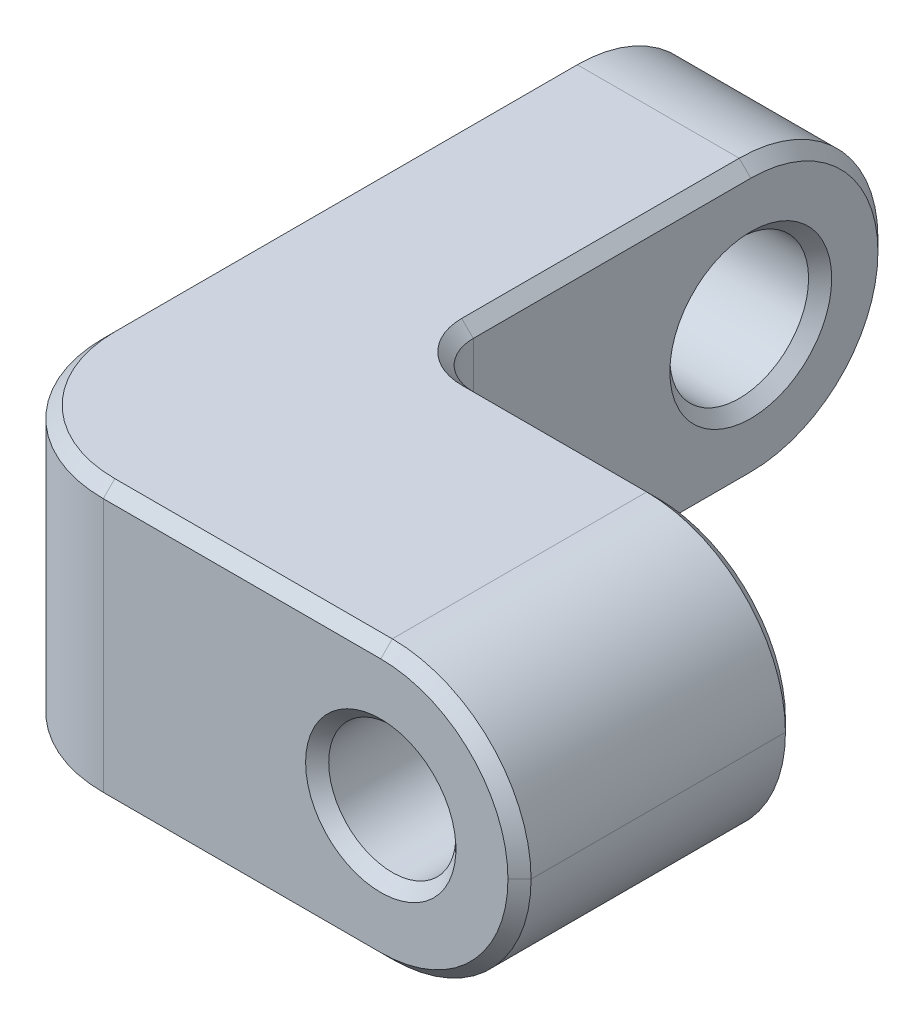
ISO-10303-21;
HEADER;
FILE_DESCRIPTION(('STEP AP214'),'2;1');
FILE_NAME('part.step','',(''),(''),'','','');
FILE_SCHEMA(('AUTOMOTIVE_DESIGN { 1 0 10303 214 1 1 1 1 }'));
ENDSEC;
DATA;
#1=APPLICATION_CONTEXT('core data for automotive mechanical design processes');
#2=APPLICATION_PROTOCOL_DEFINITION('international standard','automotive_design',2000,#1);
#3=PRODUCT_CONTEXT('',#1,'mechanical');
#4=PRODUCT('Part','Part','',(#3));
#5=PRODUCT_RELATED_PRODUCT_CATEGORY('part','',(#4));
#6=PRODUCT_DEFINITION_FORMATION('','',#4);
#7=PRODUCT_DEFINITION_CONTEXT('part definition',#1,'design');
#8=PRODUCT_DEFINITION('design','',#6,#7);
#9=PRODUCT_DEFINITION_SHAPE('','',#8);
#10=(LENGTH_UNIT() NAMED_UNIT(*) SI_UNIT(.MILLI.,.METRE.));
#11=(NAMED_UNIT(*) PLANE_ANGLE_UNIT() SI_UNIT($,.RADIAN.));
#12=(NAMED_UNIT(*) SI_UNIT($,.STERADIAN.) SOLID_ANGLE_UNIT());
#13=UNCERTAINTY_MEASURE_WITH_UNIT(LENGTH_MEASURE(1.E-05),#10,'distance_accuracy_value','');
#14=(GEOMETRIC_REPRESENTATION_CONTEXT(3) GLOBAL_UNCERTAINTY_ASSIGNED_CONTEXT((#13)) GLOBAL_UNIT_ASSIGNED_CONTEXT((#10,
#11,#12)) REPRESENTATION_CONTEXT('',''));
#15=CARTESIAN_POINT('',(0.,0.,0.));
#16=DIRECTION('',(0.,0.,1.));
#17=DIRECTION('',(1.,0.,0.));
#18=AXIS2_PLACEMENT_3D('',#15,#16,#17);
#19=CARTESIAN_POINT('',(0.,4.7625,-25.4));
#20=DIRECTION('',(1.,0.,0.));
#21=DIRECTION('',(0.,0.,-1.));
#22=AXIS2_PLACEMENT_3D('',#19,#20,#21);
#23=PLANE('',#22);
#24=CARTESIAN_POINT('',(0.,0.,-20.6375));
#25=DIRECTION('',(1.,0.,0.));
#26=DIRECTION('',(0.,0.,-1.));
#27=AXIS2_PLACEMENT_3D('',#24,#25,#26);
#28=CIRCLE('',#27,2.77812499999995);
#29=CARTESIAN_POINT('',(0.,0.,-23.4156249999999));
#30=VERTEX_POINT('',#29);
#31=EDGE_CURVE('E461',#30,#30,#28,.T.);
#32=ORIENTED_EDGE('',*,*,#31,.T.);
#33=EDGE_LOOP('',(#32));
#34=FACE_BOUND('',#33,.T.);
#35=CARTESIAN_POINT('',(0.,0.,-20.6375));
#36=DIRECTION('',(1.,0.,0.));
#37=DIRECTION('',(0.,0.,-1.));
#38=AXIS2_PLACEMENT_3D('',#35,#36,#37);
#39=CIRCLE('',#38,4.365625);
#40=CARTESIAN_POINT('',(0.,0.,-25.003125));
#41=VERTEX_POINT('',#40);
#42=CARTESIAN_POINT('',(0.,-4.365625,-20.6375));
#43=VERTEX_POINT('',#42);
#44=EDGE_CURVE('E454',#41,#43,#39,.F.);
#45=ORIENTED_EDGE('',*,*,#44,.T.);
#46=DIRECTION('',(0.,0.,1.));
#47=VECTOR('',#46,1.);
#48=CARTESIAN_POINT('',(0.,-4.365625,-25.4));
#49=LINE('',#48,#47);
#50=CARTESIAN_POINT('',(0.,-4.365625,-4.7625));
#51=VERTEX_POINT('',#50);
#52=EDGE_CURVE('E458',#43,#51,#49,.T.);
#53=ORIENTED_EDGE('',*,*,#52,.T.);
#54=DIRECTION('',(0.,-1.,0.));
#55=VECTOR('',#54,1.);
#56=CARTESIAN_POINT('',(0.,4.7625,-4.7625));
#57=LINE('',#56,#55);
#58=CARTESIAN_POINT('',(0.,4.365625,-4.7625));
#59=VERTEX_POINT('',#58);
#60=EDGE_CURVE('E476',#51,#59,#57,.F.);
#61=ORIENTED_EDGE('',*,*,#60,.T.);
#62=DIRECTION('',(0.,0.,-1.));
#63=VECTOR('',#62,1.);
#64=CARTESIAN_POINT('',(0.,4.365625,-20.6375));
#65=LINE('',#64,#63);
#66=CARTESIAN_POINT('',(0.,4.365625,-20.6375));
#67=VERTEX_POINT('',#66);
#68=EDGE_CURVE('E448',#59,#67,#65,.T.);
#69=ORIENTED_EDGE('',*,*,#68,.T.);
#70=CARTESIAN_POINT('',(0.,0.,-20.6375));
#71=DIRECTION('',(1.,0.,0.));
#72=DIRECTION('',(0.,0.,-1.));
#73=AXIS2_PLACEMENT_3D('',#70,#71,#72);
#74=CIRCLE('',#73,4.365625);
#75=EDGE_CURVE('E451',#67,#41,#74,.F.);
#76=ORIENTED_EDGE('',*,*,#75,.T.);
#77=EDGE_LOOP('',(#45,#53,#61,#69,#76));
#78=FACE_BOUND('',#77,.T.);
#79=ADVANCED_FACE('F41',(#34,#78),#23,.F.);
#80=CARTESIAN_POINT('',(0.,4.7625,0.));
#81=DIRECTION('',(0.,0.,-1.));
#82=DIRECTION('',(-1.,0.,0.));
#83=AXIS2_PLACEMENT_3D('',#80,#81,#82);
#84=PLANE('',#83);
#85=CARTESIAN_POINT('',(14.2875,0.,0.));
#86=DIRECTION('',(0.,0.,-1.));
#87=DIRECTION('',(-1.,0.,0.));
#88=AXIS2_PLACEMENT_3D('',#85,#86,#87);
#89=CIRCLE('',#88,2.57968750000001);
#90=CARTESIAN_POINT('',(11.7078125,0.,0.));
#91=VERTEX_POINT('',#90);
#92=EDGE_CURVE('E364',#91,#91,#89,.T.);
#93=ORIENTED_EDGE('',*,*,#92,.T.);
#94=EDGE_LOOP('',(#93));
#95=FACE_BOUND('',#94,.T.);
#96=DIRECTION('',(0.,-1.,0.));
#97=VECTOR('',#96,1.);
#98=CARTESIAN_POINT('',(4.7625,4.7625,0.));
#99=LINE('',#98,#97);
#100=CARTESIAN_POINT('',(4.7625,4.365625,0.));
#101=VERTEX_POINT('',#100);
#102=CARTESIAN_POINT('',(4.7625,-4.365625,0.));
#103=VERTEX_POINT('',#102);
#104=EDGE_CURVE('E687',#101,#103,#99,.T.);
#105=ORIENTED_EDGE('',*,*,#104,.T.);
#106=DIRECTION('',(1.,0.,0.));
#107=VECTOR('',#106,1.);
#108=CARTESIAN_POINT('',(0.,-4.365625,0.));
#109=LINE('',#108,#107);
#110=CARTESIAN_POINT('',(14.2875,-4.365625,0.));
#111=VERTEX_POINT('',#110);
#112=EDGE_CURVE('E377',#103,#111,#109,.T.);
#113=ORIENTED_EDGE('',*,*,#112,.T.);
#114=CARTESIAN_POINT('',(14.2875,0.,0.));
#115=DIRECTION('',(0.,0.,-1.));
#116=DIRECTION('',(-1.,0.,0.));
#117=AXIS2_PLACEMENT_3D('',#114,#115,#116);
#118=CIRCLE('',#117,4.365625);
#119=CARTESIAN_POINT('',(18.653125,0.,0.));
#120=VERTEX_POINT('',#119);
#121=EDGE_CURVE('E374',#111,#120,#118,.F.);
#122=ORIENTED_EDGE('',*,*,#121,.T.);
#123=CARTESIAN_POINT('',(14.2875,0.,0.));
#124=DIRECTION('',(0.,0.,-1.));
#125=DIRECTION('',(-1.,0.,0.));
#126=AXIS2_PLACEMENT_3D('',#123,#124,#125);
#127=CIRCLE('',#126,4.365625);
#128=CARTESIAN_POINT('',(14.2875,4.365625,0.));
#129=VERTEX_POINT('',#128);
#130=EDGE_CURVE('E371',#120,#129,#127,.F.);
#131=ORIENTED_EDGE('',*,*,#130,.T.);
#132=DIRECTION('',(-1.,0.,0.));
#133=VECTOR('',#132,1.);
#134=CARTESIAN_POINT('',(4.7625,4.365625,0.));
#135=LINE('',#134,#133);
#136=EDGE_CURVE('E368',#129,#101,#135,.T.);
#137=ORIENTED_EDGE('',*,*,#136,.T.);
#138=EDGE_LOOP('',(#105,#113,#122,#131,#137));
#139=FACE_BOUND('',#138,.T.);
#140=ADVANCED_FACE('F490',(#95,#139),#84,.F.);
#141=CARTESIAN_POINT('',(19.05,4.7625,-9.525));
#142=DIRECTION('',(0.,0.,1.));
#143=DIRECTION('',(1.,0.,0.));
#144=AXIS2_PLACEMENT_3D('',#141,#142,#143);
#145=PLANE('',#144);
#146=CARTESIAN_POINT('',(14.2875,0.,-9.525));
#147=DIRECTION('',(0.,0.,1.));
#148=DIRECTION('',(1.,0.,0.));
#149=AXIS2_PLACEMENT_3D('',#146,#147,#148);
#150=CIRCLE('',#149,2.5796875);
#151=CARTESIAN_POINT('',(16.8671875,0.,-9.525));
#152=VERTEX_POINT('',#151);
#153=EDGE_CURVE('E213',#152,#152,#150,.T.);
#154=ORIENTED_EDGE('',*,*,#153,.T.);
#155=EDGE_LOOP('',(#154));
#156=FACE_BOUND('',#155,.T.);
#157=DIRECTION('',(0.,-1.,0.));
#158=VECTOR('',#157,1.);
#159=CARTESIAN_POINT('',(7.93749999999999,4.7625,-9.525));
#160=LINE('',#159,#158);
#161=CARTESIAN_POINT('',(7.93749999999999,-4.365625,-9.525));
#162=VERTEX_POINT('',#161);
#163=CARTESIAN_POINT('',(7.93749999999999,4.365625,-9.525));
#164=VERTEX_POINT('',#163);
#165=EDGE_CURVE('E200',#162,#164,#160,.F.);
#166=ORIENTED_EDGE('',*,*,#165,.T.);
#167=DIRECTION('',(1.,0.,0.));
#168=VECTOR('',#167,1.);
#169=CARTESIAN_POINT('',(14.2875,4.365625,-9.525));
#170=LINE('',#169,#168);
#171=CARTESIAN_POINT('',(14.2875,4.365625,-9.525));
#172=VERTEX_POINT('',#171);
#173=EDGE_CURVE('E11',#164,#172,#170,.T.);
#174=ORIENTED_EDGE('',*,*,#173,.T.);
#175=CARTESIAN_POINT('',(14.2875,0.,-9.525));
#176=DIRECTION('',(0.,0.,1.));
#177=DIRECTION('',(1.,0.,0.));
#178=AXIS2_PLACEMENT_3D('',#175,#176,#177);
#179=CIRCLE('',#178,4.365625);
#180=CARTESIAN_POINT('',(18.653125,0.,-9.525));
#181=VERTEX_POINT('',#180);
#182=EDGE_CURVE('E52',#172,#181,#179,.F.);
#183=ORIENTED_EDGE('',*,*,#182,.T.);
#184=CARTESIAN_POINT('',(14.2875,0.,-9.525));
#185=DIRECTION('',(0.,0.,1.));
#186=DIRECTION('',(1.,0.,0.));
#187=AXIS2_PLACEMENT_3D('',#184,#185,#186);
#188=CIRCLE('',#187,4.365625);
#189=CARTESIAN_POINT('',(14.2875,-4.365625,-9.525));
#190=VERTEX_POINT('',#189);
#191=EDGE_CURVE('E408',#181,#190,#188,.F.);
#192=ORIENTED_EDGE('',*,*,#191,.T.);
#193=DIRECTION('',(-1.,0.,0.));
#194=VECTOR('',#193,1.);
#195=CARTESIAN_POINT('',(19.05,-4.365625,-9.525));
#196=LINE('',#195,#194);
#197=EDGE_CURVE('E405',#190,#162,#196,.T.);
#198=ORIENTED_EDGE('',*,*,#197,.T.);
#199=EDGE_LOOP('',(#166,#174,#183,#192,#198));
#200=FACE_BOUND('',#199,.T.);
#201=ADVANCED_FACE('F411',(#156,#200),#145,.F.);
#202=CARTESIAN_POINT('',(6.35,4.7625,-9.525));
#203=DIRECTION('',(-1.,0.,0.));
#204=DIRECTION('',(0.,0.,1.));
#205=AXIS2_PLACEMENT_3D('',#202,#203,#204);
#206=PLANE('',#205);
#207=CARTESIAN_POINT('',(6.34999999999998,0.,-20.6375));
#208=DIRECTION('',(-1.,0.,0.));
#209=DIRECTION('',(0.,0.,1.));
#210=AXIS2_PLACEMENT_3D('',#207,#208,#209);
#211=CIRCLE('',#210,2.77812499999999);
#212=CARTESIAN_POINT('',(6.34999999999999,0.,-17.859375));
#213=VERTEX_POINT('',#212);
#214=EDGE_CURVE('E190',#213,#213,#211,.T.);
#215=ORIENTED_EDGE('',*,*,#214,.T.);
#216=EDGE_LOOP('',(#215));
#217=FACE_BOUND('',#216,.T.);
#218=CARTESIAN_POINT('',(6.34999999999998,0.,-20.6375));
#219=DIRECTION('',(-1.,0.,0.));
#220=DIRECTION('',(0.,0.,1.));
#221=AXIS2_PLACEMENT_3D('',#218,#219,#220);
#222=CIRCLE('',#221,4.365625);
#223=CARTESIAN_POINT('',(6.34999999999998,0.,-25.003125));
#224=VERTEX_POINT('',#223);
#225=CARTESIAN_POINT('',(6.34999999999998,4.365625,-20.6375));
#226=VERTEX_POINT('',#225);
#227=EDGE_CURVE('E185',#224,#226,#222,.F.);
#228=ORIENTED_EDGE('',*,*,#227,.T.);
#229=DIRECTION('',(0.,0.,1.));
#230=VECTOR('',#229,1.);
#231=CARTESIAN_POINT('',(6.34999999999999,4.365625,-11.1125));
#232=LINE('',#231,#230);
#233=CARTESIAN_POINT('',(6.34999999999999,4.365625,-11.1125));
#234=VERTEX_POINT('',#233);
#235=EDGE_CURVE('E179',#226,#234,#232,.T.);
#236=ORIENTED_EDGE('',*,*,#235,.T.);
#237=DIRECTION('',(0.,-1.,0.));
#238=VECTOR('',#237,1.);
#239=CARTESIAN_POINT('',(6.34999999999999,-4.7625,-11.1125));
#240=LINE('',#239,#238);
#241=CARTESIAN_POINT('',(6.34999999999999,-4.365625,-11.1125));
#242=VERTEX_POINT('',#241);
#243=EDGE_CURVE('E182',#234,#242,#240,.T.);
#244=ORIENTED_EDGE('',*,*,#243,.T.);
#245=DIRECTION('',(0.,0.,-1.));
#246=VECTOR('',#245,1.);
#247=CARTESIAN_POINT('',(6.35,-4.365625,-9.525));
#248=LINE('',#247,#246);
#249=CARTESIAN_POINT('',(6.34999999999998,-4.365625,-20.6375));
#250=VERTEX_POINT('',#249);
#251=EDGE_CURVE('E424',#242,#250,#248,.T.);
#252=ORIENTED_EDGE('',*,*,#251,.T.);
#253=CARTESIAN_POINT('',(6.34999999999998,0.,-20.6375));
#254=DIRECTION('',(-1.,0.,0.));
#255=DIRECTION('',(0.,0.,1.));
#256=AXIS2_PLACEMENT_3D('',#253,#254,#255);
#257=CIRCLE('',#256,4.365625);
#258=EDGE_CURVE('E428',#250,#224,#257,.F.);
#259=ORIENTED_EDGE('',*,*,#258,.T.);
#260=EDGE_LOOP('',(#228,#236,#244,#252,#259));
#261=FACE_BOUND('',#260,.T.);
#262=ADVANCED_FACE('F181',(#217,#261),#206,.F.);
#263=CARTESIAN_POINT('',(0.,4.7625,0.));
#264=DIRECTION('',(0.,1.,0.));
#265=DIRECTION('',(0.,0.,1.));
#266=AXIS2_PLACEMENT_3D('',#263,#264,#265);
#267=PLANE('',#266);
#268=DIRECTION('',(-1.,0.,0.));
#269=VECTOR('',#268,1.);
#270=CARTESIAN_POINT('',(0.,4.7625,-20.6375));
#271=LINE('',#270,#269);
#272=CARTESIAN_POINT('',(5.95312499999998,4.7625,-20.6375));
#273=VERTEX_POINT('',#272);
#274=CARTESIAN_POINT('',(0.396874999999981,4.7625,-20.6375));
#275=VERTEX_POINT('',#274);
#276=EDGE_CURVE('E201',#273,#275,#271,.T.);
#277=ORIENTED_EDGE('',*,*,#276,.T.);
#278=DIRECTION('',(0.,0.,1.));
#279=VECTOR('',#278,1.);
#280=CARTESIAN_POINT('',(0.396874999999994,4.7625,-4.7625));
#281=LINE('',#280,#279);
#282=CARTESIAN_POINT('',(0.396874999999994,4.7625,-4.7625));
#283=VERTEX_POINT('',#282);
#284=EDGE_CURVE('E355',#275,#283,#281,.T.);
#285=ORIENTED_EDGE('',*,*,#284,.T.);
#286=CARTESIAN_POINT('',(4.7625,4.7625,-4.7625));
#287=DIRECTION('',(0.,1.,0.));
#288=DIRECTION('',(0.,0.,1.));
#289=AXIS2_PLACEMENT_3D('',#286,#287,#288);
#290=CIRCLE('',#289,4.365625);
#291=CARTESIAN_POINT('',(4.7625,4.7625,-0.396874999999998));
#292=VERTEX_POINT('',#291);
#293=EDGE_CURVE('E352',#283,#292,#290,.T.);
#294=ORIENTED_EDGE('',*,*,#293,.T.);
#295=DIRECTION('',(1.,0.,0.));
#296=VECTOR('',#295,1.);
#297=CARTESIAN_POINT('',(14.2875,4.7625,-0.396874999999998));
#298=LINE('',#297,#296);
#299=CARTESIAN_POINT('',(14.2875,4.7625,-0.396874999999998));
#300=VERTEX_POINT('',#299);
#301=EDGE_CURVE('E349',#292,#300,#298,.T.);
#302=ORIENTED_EDGE('',*,*,#301,.T.);
#303=DIRECTION('',(0.,0.,-1.));
#304=VECTOR('',#303,1.);
#305=CARTESIAN_POINT('',(14.2875,4.7625,-9.525));
#306=LINE('',#305,#304);
#307=CARTESIAN_POINT('',(14.2875,4.7625,-9.12812499999999));
#308=VERTEX_POINT('',#307);
#309=EDGE_CURVE('E670',#300,#308,#306,.T.);
#310=ORIENTED_EDGE('',*,*,#309,.T.);
#311=DIRECTION('',(-1.,0.,0.));
#312=VECTOR('',#311,1.);
#313=CARTESIAN_POINT('',(7.93749999999999,4.7625,-9.12812499999999));
#314=LINE('',#313,#312);
#315=CARTESIAN_POINT('',(7.93749999999999,4.7625,-9.12812499999999));
#316=VERTEX_POINT('',#315);
#317=EDGE_CURVE('E341',#308,#316,#314,.T.);
#318=ORIENTED_EDGE('',*,*,#317,.T.);
#319=CARTESIAN_POINT('',(7.93749999999999,4.7625,-11.1125));
#320=DIRECTION('',(0.,1.,0.));
#321=DIRECTION('',(0.,0.,1.));
#322=AXIS2_PLACEMENT_3D('',#319,#320,#321);
#323=CIRCLE('',#322,1.98437500000001);
#324=CARTESIAN_POINT('',(5.95312499999999,4.7625,-11.1125));
#325=VERTEX_POINT('',#324);
#326=EDGE_CURVE('E344',#316,#325,#323,.F.);
#327=ORIENTED_EDGE('',*,*,#326,.T.);
#328=DIRECTION('',(0.,0.,-1.));
#329=VECTOR('',#328,1.);
#330=CARTESIAN_POINT('',(5.95312499999998,4.7625,-20.6375));
#331=LINE('',#330,#329);
#332=EDGE_CURVE('E216',#325,#273,#331,.T.);
#333=ORIENTED_EDGE('',*,*,#332,.T.);
#334=EDGE_LOOP('',(#277,#285,#294,#302,#310,#318,#327,#333));
#335=FACE_BOUND('',#334,.T.);
#336=ADVANCED_FACE('F675',(#335),#267,.T.);
#337=CARTESIAN_POINT('',(0.,-4.7625,0.));
#338=DIRECTION('',(0.,1.,0.));
#339=DIRECTION('',(0.,0.,1.));
#340=AXIS2_PLACEMENT_3D('',#337,#338,#339);
#341=PLANE('',#340);
#342=CARTESIAN_POINT('',(4.7625,-4.7625,-4.7625));
#343=DIRECTION('',(0.,1.,0.));
#344=DIRECTION('',(0.,0.,1.));
#345=AXIS2_PLACEMENT_3D('',#342,#343,#344);
#346=CIRCLE('',#345,4.365625);
#347=CARTESIAN_POINT('',(4.7625,-4.7625,-0.396874999999998));
#348=VERTEX_POINT('',#347);
#349=CARTESIAN_POINT('',(0.396874999999995,-4.7625,-4.7625));
#350=VERTEX_POINT('',#349);
#351=EDGE_CURVE('E335',#348,#350,#346,.F.);
#352=ORIENTED_EDGE('',*,*,#351,.T.);
#353=DIRECTION('',(0.,0.,-1.));
#354=VECTOR('',#353,1.);
#355=CARTESIAN_POINT('',(0.396874999999998,-4.7625,0.));
#356=LINE('',#355,#354);
#357=CARTESIAN_POINT('',(0.396874999999981,-4.7625,-20.6375));
#358=VERTEX_POINT('',#357);
#359=EDGE_CURVE('E338',#350,#358,#356,.T.);
#360=ORIENTED_EDGE('',*,*,#359,.T.);
#361=DIRECTION('',(-1.,0.,0.));
#362=VECTOR('',#361,1.);
#363=CARTESIAN_POINT('',(0.,-4.7625,-20.6375));
#364=LINE('',#363,#362);
#365=CARTESIAN_POINT('',(5.95312499999998,-4.7625,-20.6375));
#366=VERTEX_POINT('',#365);
#367=EDGE_CURVE('E469',#358,#366,#364,.F.);
#368=ORIENTED_EDGE('',*,*,#367,.T.);
#369=DIRECTION('',(0.,0.,1.));
#370=VECTOR('',#369,1.);
#371=CARTESIAN_POINT('',(5.953125,-4.7625,0.));
#372=LINE('',#371,#370);
#373=CARTESIAN_POINT('',(5.95312499999999,-4.7625,-11.1125));
#374=VERTEX_POINT('',#373);
#375=EDGE_CURVE('E329',#366,#374,#372,.T.);
#376=ORIENTED_EDGE('',*,*,#375,.T.);
#377=CARTESIAN_POINT('',(7.93749999999999,-4.7625,-11.1125));
#378=DIRECTION('',(0.,1.,0.));
#379=DIRECTION('',(0.,0.,1.));
#380=AXIS2_PLACEMENT_3D('',#377,#378,#379);
#381=CIRCLE('',#380,1.98437500000001);
#382=CARTESIAN_POINT('',(7.93749999999999,-4.7625,-9.12812499999999));
#383=VERTEX_POINT('',#382);
#384=EDGE_CURVE('E326',#374,#383,#381,.T.);
#385=ORIENTED_EDGE('',*,*,#384,.T.);
#386=DIRECTION('',(1.,0.,0.));
#387=VECTOR('',#386,1.);
#388=CARTESIAN_POINT('',(0.,-4.7625,-9.12812499999999));
#389=LINE('',#388,#387);
#390=CARTESIAN_POINT('',(14.2875,-4.7625,-9.12812499999999));
#391=VERTEX_POINT('',#390);
#392=EDGE_CURVE('E317',#383,#391,#389,.T.);
#393=ORIENTED_EDGE('',*,*,#392,.T.);
#394=DIRECTION('',(0.,0.,-1.));
#395=VECTOR('',#394,1.);
#396=CARTESIAN_POINT('',(14.2875,-4.7625,0.));
#397=LINE('',#396,#395);
#398=CARTESIAN_POINT('',(14.2875,-4.7625,-0.396874999999998));
#399=VERTEX_POINT('',#398);
#400=EDGE_CURVE('E477',#391,#399,#397,.F.);
#401=ORIENTED_EDGE('',*,*,#400,.T.);
#402=DIRECTION('',(-1.,0.,0.));
#403=VECTOR('',#402,1.);
#404=CARTESIAN_POINT('',(0.,-4.7625,-0.396874999999998));
#405=LINE('',#404,#403);
#406=EDGE_CURVE('E332',#399,#348,#405,.T.);
#407=ORIENTED_EDGE('',*,*,#406,.T.);
#408=EDGE_LOOP('',(#352,#360,#368,#376,#385,#393,#401,#407));
#409=FACE_BOUND('',#408,.T.);
#410=ADVANCED_FACE('F473',(#409),#341,.F.);
#411=CARTESIAN_POINT('',(14.2875,0.,0.));
#412=DIRECTION('',(0.,0.,-1.));
#413=DIRECTION('',(-1.,0.,0.));
#414=AXIS2_PLACEMENT_3D('',#411,#412,#413);
#415=CYLINDRICAL_SURFACE('',#414,2.1828125);
#416=CARTESIAN_POINT('',(14.2875,0.,-0.396875000000009));
#417=DIRECTION('',(0.,0.,-1.));
#418=DIRECTION('',(-1.,0.,0.));
#419=AXIS2_PLACEMENT_3D('',#416,#417,#418);
#420=CIRCLE('',#419,2.1828125);
#421=CARTESIAN_POINT('',(12.1046875,0.,-0.396875000000009));
#422=VERTEX_POINT('',#421);
#423=EDGE_CURVE('E396',#422,#422,#420,.F.);
#424=ORIENTED_EDGE('',*,*,#423,.T.);
#425=EDGE_LOOP('',(#424));
#426=FACE_BOUND('',#425,.T.);
#427=CARTESIAN_POINT('',(14.2875,0.,-9.128125));
#428=DIRECTION('',(0.,0.,1.));
#429=DIRECTION('',(1.,0.,0.));
#430=AXIS2_PLACEMENT_3D('',#427,#428,#429);
#431=CIRCLE('',#430,2.1828125);
#432=CARTESIAN_POINT('',(16.4703125,0.,-9.128125));
#433=VERTEX_POINT('',#432);
#434=EDGE_CURVE('E392',#433,#433,#431,.F.);
#435=ORIENTED_EDGE('',*,*,#434,.T.);
#436=EDGE_LOOP('',(#435));
#437=FACE_BOUND('',#436,.T.);
#438=ADVANCED_FACE('F728',(#426,#437),#415,.F.);
#439=CARTESIAN_POINT('',(0.,0.,-20.6375));
#440=DIRECTION('',(1.,0.,0.));
#441=DIRECTION('',(0.,0.,-1.));
#442=AXIS2_PLACEMENT_3D('',#439,#440,#441);
#443=CYLINDRICAL_SURFACE('',#442,2.38125);
#444=CARTESIAN_POINT('',(5.95312499999999,0.,-20.6375));
#445=DIRECTION('',(-1.,0.,0.));
#446=DIRECTION('',(0.,0.,1.));
#447=AXIS2_PLACEMENT_3D('',#444,#445,#446);
#448=CIRCLE('',#447,2.38125);
#449=CARTESIAN_POINT('',(5.95312499999999,0.,-23.01875));
#450=VERTEX_POINT('',#449);
#451=EDGE_CURVE('E444',#450,#450,#448,.F.);
#452=CARTESIAN_POINT('',(0.396874999999938,0.,-20.6375));
#453=DIRECTION('',(1.,0.,0.));
#454=DIRECTION('',(0.,0.,-1.));
#455=AXIS2_PLACEMENT_3D('',#452,#453,#454);
#456=CIRCLE('',#455,2.38125);
#457=CARTESIAN_POINT('',(0.396874999999938,0.,-23.01875));
#458=VERTEX_POINT('',#457);
#459=EDGE_CURVE('E440',#458,#458,#456,.F.);
#460=CARTESIAN_POINT('',(5.95312499999999,0.,-23.01875));
#461=CARTESIAN_POINT('',(5.89524739583332,0.,-23.01875));
#462=CARTESIAN_POINT('',(5.83736979166666,0.,-23.01875));
#463=CARTESIAN_POINT('',(5.72161458333332,0.,-23.01875));
#464=CARTESIAN_POINT('',(5.66373697916665,0.,-23.01875));
#465=CARTESIAN_POINT('',(5.54798177083332,0.,-23.01875));
#466=CARTESIAN_POINT('',(5.49010416666665,0.,-23.01875));
#467=CARTESIAN_POINT('',(5.37434895833332,0.,-23.01875));
#468=CARTESIAN_POINT('',(5.31647135416665,0.,-23.01875));
#469=CARTESIAN_POINT('',(5.20071614583332,0.,-23.01875));
#470=CARTESIAN_POINT('',(5.14283854166665,0.,-23.01875));
#471=CARTESIAN_POINT('',(5.02708333333331,0.,-23.01875));
#472=CARTESIAN_POINT('',(4.96920572916665,0.,-23.01875));
#473=CARTESIAN_POINT('',(4.85345052083331,0.,-23.01875));
#474=CARTESIAN_POINT('',(4.79557291666665,0.,-23.01875));
#475=CARTESIAN_POINT('',(4.67981770833331,0.,-23.01875));
#476=CARTESIAN_POINT('',(4.62194010416664,0.,-23.01875));
#477=CARTESIAN_POINT('',(4.50618489583331,0.,-23.01875));
#478=CARTESIAN_POINT('',(4.44830729166664,0.,-23.01875));
#479=CARTESIAN_POINT('',(4.33255208333331,0.,-23.01875));
#480=CARTESIAN_POINT('',(4.27467447916664,0.,-23.01875));
#481=CARTESIAN_POINT('',(4.15891927083331,0.,-23.01875));
#482=CARTESIAN_POINT('',(4.10104166666664,0.,-23.01875));
#483=CARTESIAN_POINT('',(3.9852864583333,0.,-23.01875));
#484=CARTESIAN_POINT('',(3.92740885416664,0.,-23.01875));
#485=CARTESIAN_POINT('',(3.8116536458333,0.,-23.01875));
#486=CARTESIAN_POINT('',(3.75377604166664,0.,-23.01875));
#487=CARTESIAN_POINT('',(3.6380208333333,0.,-23.01875));
#488=CARTESIAN_POINT('',(3.58014322916663,0.,-23.01875));
#489=CARTESIAN_POINT('',(3.4643880208333,0.,-23.01875));
#490=CARTESIAN_POINT('',(3.40651041666663,0.,-23.01875));
#491=CARTESIAN_POINT('',(3.2907552083333,0.,-23.01875));
#492=CARTESIAN_POINT('',(3.23287760416663,0.,-23.01875));
#493=CARTESIAN_POINT('',(3.1171223958333,0.,-23.01875));
#494=CARTESIAN_POINT('',(3.05924479166663,0.,-23.01875));
#495=CARTESIAN_POINT('',(2.9434895833333,0.,-23.01875));
#496=CARTESIAN_POINT('',(2.88561197916663,0.,-23.01875));
#497=CARTESIAN_POINT('',(2.76985677083329,0.,-23.01875));
#498=CARTESIAN_POINT('',(2.71197916666663,0.,-23.01875));
#499=CARTESIAN_POINT('',(2.59622395833329,0.,-23.01875));
#500=CARTESIAN_POINT('',(2.53834635416662,0.,-23.01875));
#501=CARTESIAN_POINT('',(2.42259114583329,0.,-23.01875));
#502=CARTESIAN_POINT('',(2.36471354166662,0.,-23.01875));
#503=CARTESIAN_POINT('',(2.24895833333329,0.,-23.01875));
#504=CARTESIAN_POINT('',(2.19108072916662,0.,-23.01875));
#505=CARTESIAN_POINT('',(2.07532552083329,0.,-23.01875));
#506=CARTESIAN_POINT('',(2.01744791666662,0.,-23.01875));
#507=CARTESIAN_POINT('',(1.90169270833329,0.,-23.01875));
#508=CARTESIAN_POINT('',(1.84381510416662,0.,-23.01875));
#509=CARTESIAN_POINT('',(1.72805989583328,0.,-23.01875));
#510=CARTESIAN_POINT('',(1.67018229166662,0.,-23.01875));
#511=CARTESIAN_POINT('',(1.55442708333328,0.,-23.01875));
#512=CARTESIAN_POINT('',(1.49654947916661,0.,-23.01875));
#513=CARTESIAN_POINT('',(1.38079427083328,0.,-23.01875));
#514=CARTESIAN_POINT('',(1.32291666666661,0.,-23.01875));
#515=CARTESIAN_POINT('',(1.20716145833328,0.,-23.01875));
#516=CARTESIAN_POINT('',(1.14928385416661,0.,-23.01875));
#517=CARTESIAN_POINT('',(1.03352864583328,0.,-23.01875));
#518=CARTESIAN_POINT('',(0.97565104166661,0.,-23.01875));
#519=CARTESIAN_POINT('',(0.859895833333275,0.,-23.01875));
#520=CARTESIAN_POINT('',(0.802018229166608,0.,-23.01875));
#521=CARTESIAN_POINT('',(0.686263020833274,0.,-23.01875));
#522=CARTESIAN_POINT('',(0.628385416666607,0.,-23.01875));
#523=CARTESIAN_POINT('',(0.512630208333272,0.,-23.01875));
#524=CARTESIAN_POINT('',(0.454752604166605,0.,-23.01875));
#525=CARTESIAN_POINT('',(0.396874999999938,0.,-23.01875));
#526=B_SPLINE_CURVE_WITH_KNOTS('',3,(#460,#461,#462,#463,#464,#465,#466,#467,#468,#469,#470,
#471,#472,#473,#474,#475,#476,#477,#478,#479,#480,#481,#482,#483,#484,#485,#486,#487,#488,#489,
#490,#491,#492,#493,#494,#495,#496,#497,#498,#499,#500,#501,#502,#503,#504,#505,#506,#507,#508,
#509,#510,#511,#512,#513,#514,#515,#516,#517,#518,#519,#520,#521,#522,#523,#524,#525),
.UNSPECIFIED.,.F.,.F.,(4,2,2,2,2,2,2,2,2,2,2,2,2,2,2,2,2,2,2,2,2,2,2,2,2,2,2,2,2,2,2,2,4),(0.,
0.173632812500001,0.347265625000003,0.520898437500005,0.694531250000007,0.868164062500008,
1.04179687500001,1.21542968750001,1.38906250000001,1.56269531250001,1.73632812500002,
1.90996093750002,2.08359375000002,2.25722656250002,2.43085937500002,2.60449218750002,
2.77812500000003,2.95175781250003,3.12539062500003,3.29902343750003,3.47265625000003,
3.64628906250003,3.81992187500004,3.99355468750004,4.16718750000004,4.34082031250004,
4.51445312500004,4.68808593750004,4.86171875000005,5.03535156250005,5.20898437500005,
5.38261718750005,5.55625000000005),.UNSPECIFIED.);
#527=EDGE_CURVE('BSEAM505',#450,#458,#526,.T.);
#528=ORIENTED_EDGE('',*,*,#451,.T.);
#529=ORIENTED_EDGE('',*,*,#459,.T.);
#530=ORIENTED_EDGE('',*,*,#527,.T.);
#531=ORIENTED_EDGE('',*,*,#527,.F.);
#532=EDGE_LOOP('',(#528,#530,#529,#531));
#533=FACE_BOUND('',#532,.T.);
#534=ADVANCED_FACE('F505',(#533),#443,.F.);
#535=CARTESIAN_POINT('',(4.7625,4.7625,-4.7625));
#536=DIRECTION('',(0.,-1.,0.));
#537=DIRECTION('',(0.,0.,-1.));
#538=AXIS2_PLACEMENT_3D('',#535,#536,#537);
#539=CYLINDRICAL_SURFACE('',#538,4.7625);
#540=ORIENTED_EDGE('',*,*,#60,.F.);
#541=CARTESIAN_POINT('',(4.7625,-4.365625,-4.7625));
#542=DIRECTION('',(0.,1.,0.));
#543=DIRECTION('',(0.,0.,1.));
#544=AXIS2_PLACEMENT_3D('',#541,#542,#543);
#545=CIRCLE('',#544,4.7625);
#546=EDGE_CURVE('E361',#51,#103,#545,.T.);
#547=ORIENTED_EDGE('',*,*,#546,.T.);
#548=ORIENTED_EDGE('',*,*,#104,.F.);
#549=CARTESIAN_POINT('',(4.7625,4.365625,-4.7625));
#550=DIRECTION('',(0.,1.,0.));
#551=DIRECTION('',(0.,0.,1.));
#552=AXIS2_PLACEMENT_3D('',#549,#550,#551);
#553=CIRCLE('',#552,4.7625);
#554=EDGE_CURVE('E358',#101,#59,#553,.F.);
#555=ORIENTED_EDGE('',*,*,#554,.T.);
#556=EDGE_LOOP('',(#540,#547,#548,#555));
#557=FACE_BOUND('',#556,.T.);
#558=ADVANCED_FACE('F501',(#557),#539,.T.);
#559=CARTESIAN_POINT('',(0.,0.,-20.6375));
#560=DIRECTION('',(1.,0.,0.));
#561=DIRECTION('',(0.,0.,-1.));
#562=AXIS2_PLACEMENT_3D('',#559,#560,#561);
#563=CYLINDRICAL_SURFACE('',#562,4.7625);
#564=DIRECTION('',(-1.,0.,0.));
#565=VECTOR('',#564,1.);
#566=CARTESIAN_POINT('',(6.34999999999998,0.,-25.4));
#567=LINE('',#566,#565);
#568=CARTESIAN_POINT('',(0.396874999999981,0.,-25.4));
#569=VERTEX_POINT('',#568);
#570=CARTESIAN_POINT('',(5.95312499999998,0.,-25.4));
#571=VERTEX_POINT('',#570);
#572=EDGE_CURVE('E470',#569,#571,#567,.F.);
#573=ORIENTED_EDGE('',*,*,#572,.F.);
#574=CARTESIAN_POINT('',(0.396874999999981,0.,-20.6375));
#575=DIRECTION('',(1.,0.,0.));
#576=DIRECTION('',(0.,0.,-1.));
#577=AXIS2_PLACEMENT_3D('',#574,#575,#576);
#578=CIRCLE('',#577,4.7625);
#579=EDGE_CURVE('E312',#569,#275,#578,.T.);
#580=ORIENTED_EDGE('',*,*,#579,.T.);
#581=ORIENTED_EDGE('',*,*,#276,.F.);
#582=CARTESIAN_POINT('',(5.95312499999998,0.,-20.6375));
#583=DIRECTION('',(-1.,0.,0.));
#584=DIRECTION('',(0.,0.,1.));
#585=AXIS2_PLACEMENT_3D('',#582,#583,#584);
#586=CIRCLE('',#585,4.7625);
#587=EDGE_CURVE('E304',#273,#571,#586,.T.);
#588=ORIENTED_EDGE('',*,*,#587,.T.);
#589=EDGE_LOOP('',(#573,#580,#581,#588));
#590=FACE_BOUND('',#589,.T.);
#591=ADVANCED_FACE('F504',(#590),#563,.T.);
#592=CARTESIAN_POINT('',(6.34999999999998,0.,-20.6375));
#593=DIRECTION('',(-1.,0.,0.));
#594=DIRECTION('',(0.,0.,1.));
#595=AXIS2_PLACEMENT_3D('',#592,#593,#594);
#596=CYLINDRICAL_SURFACE('',#595,4.7625);
#597=ORIENTED_EDGE('',*,*,#367,.F.);
#598=CARTESIAN_POINT('',(0.396874999999981,0.,-20.6375));
#599=DIRECTION('',(1.,0.,0.));
#600=DIRECTION('',(0.,0.,-1.));
#601=AXIS2_PLACEMENT_3D('',#598,#599,#600);
#602=CIRCLE('',#601,4.7625);
#603=EDGE_CURVE('E313',#358,#569,#602,.T.);
#604=ORIENTED_EDGE('',*,*,#603,.T.);
#605=ORIENTED_EDGE('',*,*,#572,.T.);
#606=CARTESIAN_POINT('',(5.95312499999998,0.,-20.6375));
#607=DIRECTION('',(-1.,0.,0.));
#608=DIRECTION('',(0.,0.,1.));
#609=AXIS2_PLACEMENT_3D('',#606,#607,#608);
#610=CIRCLE('',#609,4.7625);
#611=EDGE_CURVE('E320',#571,#366,#610,.T.);
#612=ORIENTED_EDGE('',*,*,#611,.T.);
#613=EDGE_LOOP('',(#597,#604,#605,#612));
#614=FACE_BOUND('',#613,.T.);
#615=ADVANCED_FACE('F468',(#614),#596,.T.);
#616=CARTESIAN_POINT('',(14.2875,0.,0.));
#617=DIRECTION('',(0.,0.,1.));
#618=DIRECTION('',(1.,0.,0.));
#619=AXIS2_PLACEMENT_3D('',#616,#617,#618);
#620=CYLINDRICAL_SURFACE('',#619,4.7625);
#621=ORIENTED_EDGE('',*,*,#309,.F.);
#622=CARTESIAN_POINT('',(14.2875,0.,-0.396874999999998));
#623=DIRECTION('',(0.,0.,-1.));
#624=DIRECTION('',(-1.,0.,0.));
#625=AXIS2_PLACEMENT_3D('',#622,#623,#624);
#626=CIRCLE('',#625,4.7625);
#627=CARTESIAN_POINT('',(19.05,0.,-0.396874999999998));
#628=VERTEX_POINT('',#627);
#629=EDGE_CURVE('E389',#300,#628,#626,.T.);
#630=ORIENTED_EDGE('',*,*,#629,.T.);
#631=DIRECTION('',(0.,0.,-1.));
#632=VECTOR('',#631,1.);
#633=CARTESIAN_POINT('',(19.05,0.,0.));
#634=LINE('',#633,#632);
#635=CARTESIAN_POINT('',(19.05,0.,-9.12812499999999));
#636=VERTEX_POINT('',#635);
#637=EDGE_CURVE('E298',#636,#628,#634,.F.);
#638=ORIENTED_EDGE('',*,*,#637,.F.);
#639=CARTESIAN_POINT('',(14.2875,0.,-9.12812499999999));
#640=DIRECTION('',(0.,0.,1.));
#641=DIRECTION('',(1.,0.,0.));
#642=AXIS2_PLACEMENT_3D('',#639,#640,#641);
#643=CIRCLE('',#642,4.7625);
#644=EDGE_CURVE('E386',#636,#308,#643,.T.);
#645=ORIENTED_EDGE('',*,*,#644,.T.);
#646=EDGE_LOOP('',(#621,#630,#638,#645));
#647=FACE_BOUND('',#646,.T.);
#648=ADVANCED_FACE('F509',(#647),#620,.T.);
#649=CARTESIAN_POINT('',(14.2875,0.,0.));
#650=DIRECTION('',(0.,0.,-1.));
#651=DIRECTION('',(-1.,0.,0.));
#652=AXIS2_PLACEMENT_3D('',#649,#650,#651);
#653=CYLINDRICAL_SURFACE('',#652,4.7625);
#654=ORIENTED_EDGE('',*,*,#637,.T.);
#655=CARTESIAN_POINT('',(14.2875,0.,-0.396874999999998));
#656=DIRECTION('',(0.,0.,-1.));
#657=DIRECTION('',(-1.,0.,0.));
#658=AXIS2_PLACEMENT_3D('',#655,#656,#657);
#659=CIRCLE('',#658,4.7625);
#660=EDGE_CURVE('E383',#628,#399,#659,.T.);
#661=ORIENTED_EDGE('',*,*,#660,.T.);
#662=ORIENTED_EDGE('',*,*,#400,.F.);
#663=CARTESIAN_POINT('',(14.2875,0.,-9.12812499999999));
#664=DIRECTION('',(0.,0.,1.));
#665=DIRECTION('',(1.,0.,0.));
#666=AXIS2_PLACEMENT_3D('',#663,#664,#665);
#667=CIRCLE('',#666,4.7625);
#668=EDGE_CURVE('E380',#391,#636,#667,.T.);
#669=ORIENTED_EDGE('',*,*,#668,.T.);
#670=EDGE_LOOP('',(#654,#661,#662,#669));
#671=FACE_BOUND('',#670,.T.);
#672=ADVANCED_FACE('F512',(#671),#653,.T.);
#673=CARTESIAN_POINT('',(7.93749999999999,4.7625,-11.1125));
#674=DIRECTION('',(0.,1.,0.));
#675=DIRECTION('',(0.,0.,1.));
#676=AXIS2_PLACEMENT_3D('',#673,#674,#675);
#677=CYLINDRICAL_SURFACE('',#676,1.5875);
#678=ORIENTED_EDGE('',*,*,#243,.F.);
#679=CARTESIAN_POINT('',(7.93749999999999,4.365625,-11.1125));
#680=DIRECTION('',(0.,1.,0.));
#681=DIRECTION('',(0.,0.,1.));
#682=AXIS2_PLACEMENT_3D('',#679,#680,#681);
#683=CIRCLE('',#682,1.5875);
#684=EDGE_CURVE('E196',#234,#164,#683,.T.);
#685=ORIENTED_EDGE('',*,*,#684,.T.);
#686=ORIENTED_EDGE('',*,*,#165,.F.);
#687=CARTESIAN_POINT('',(7.93749999999999,-4.365625,-11.1125));
#688=DIRECTION('',(0.,1.,0.));
#689=DIRECTION('',(0.,0.,1.));
#690=AXIS2_PLACEMENT_3D('',#687,#688,#689);
#691=CIRCLE('',#690,1.5875);
#692=EDGE_CURVE('E198',#162,#242,#691,.F.);
#693=ORIENTED_EDGE('',*,*,#692,.T.);
#694=EDGE_LOOP('',(#678,#685,#686,#693));
#695=FACE_BOUND('',#694,.T.);
#696=ADVANCED_FACE('F194',(#695),#677,.F.);
#697=CARTESIAN_POINT('',(6.34999999999998,0.,-20.6375));
#698=DIRECTION('',(1.,0.,0.));
#699=DIRECTION('',(0.,0.,-1.));
#700=AXIS2_PLACEMENT_3D('',#697,#698,#699);
#701=CONICAL_SURFACE('',#700,2.77812499999999,0.785398163397439);
#702=ORIENTED_EDGE('',*,*,#451,.F.);
#703=EDGE_LOOP('',(#702));
#704=FACE_BOUND('',#703,.T.);
#705=ORIENTED_EDGE('',*,*,#214,.F.);
#706=EDGE_LOOP('',(#705));
#707=FACE_BOUND('',#706,.T.);
#708=ADVANCED_FACE('F521',(#704,#707),#701,.F.);
#709=CARTESIAN_POINT('',(0.,0.,-20.6375));
#710=DIRECTION('',(-1.,0.,0.));
#711=DIRECTION('',(0.,0.,1.));
#712=AXIS2_PLACEMENT_3D('',#709,#710,#711);
#713=CONICAL_SURFACE('',#712,2.77812499999995,0.78539816339744);
#714=ORIENTED_EDGE('',*,*,#459,.F.);
#715=EDGE_LOOP('',(#714));
#716=FACE_BOUND('',#715,.T.);
#717=ORIENTED_EDGE('',*,*,#31,.F.);
#718=EDGE_LOOP('',(#717));
#719=FACE_BOUND('',#718,.T.);
#720=ADVANCED_FACE('F528',(#716,#719),#713,.F.);
#721=CARTESIAN_POINT('',(14.2875,0.,0.));
#722=DIRECTION('',(0.,0.,-1.));
#723=DIRECTION('',(-1.,0.,0.));
#724=AXIS2_PLACEMENT_3D('',#721,#722,#723);
#725=CONICAL_SURFACE('',#724,4.365625,0.785398163397449);
#726=DIRECTION('',(-0.707106781186548,0.,0.707106781186547));
#727=VECTOR('',#726,1.);
#728=CARTESIAN_POINT('',(19.05,0.,-0.396874999999998));
#729=LINE('',#728,#727);
#730=EDGE_CURVE('E291',#628,#120,#729,.T.);
#731=ORIENTED_EDGE('',*,*,#730,.F.);
#732=ORIENTED_EDGE('',*,*,#629,.F.);
#733=DIRECTION('',(0.,0.707106781186548,-0.707106781186547));
#734=VECTOR('',#733,1.);
#735=CARTESIAN_POINT('',(14.2875,4.365625,0.));
#736=LINE('',#735,#734);
#737=EDGE_CURVE('E295',#129,#300,#736,.T.);
#738=ORIENTED_EDGE('',*,*,#737,.F.);
#739=ORIENTED_EDGE('',*,*,#130,.F.);
#740=EDGE_LOOP('',(#731,#732,#738,#739));
#741=FACE_BOUND('',#740,.T.);
#742=ADVANCED_FACE('F535',(#741),#725,.T.);
#743=CARTESIAN_POINT('',(0.,4.7625,-0.396874999999998));
#744=DIRECTION('',(0.,0.707106781186547,0.707106781186548));
#745=DIRECTION('',(-1.,0.,0.));
#746=AXIS2_PLACEMENT_3D('',#743,#744,#745);
#747=PLANE('',#746);
#748=ORIENTED_EDGE('',*,*,#737,.T.);
#749=ORIENTED_EDGE('',*,*,#301,.F.);
#750=DIRECTION('',(0.,0.707106781186548,-0.707106781186547));
#751=VECTOR('',#750,1.);
#752=CARTESIAN_POINT('',(4.7625,4.365625,0.));
#753=LINE('',#752,#751);
#754=EDGE_CURVE('E287',#101,#292,#753,.T.);
#755=ORIENTED_EDGE('',*,*,#754,.F.);
#756=ORIENTED_EDGE('',*,*,#136,.F.);
#757=EDGE_LOOP('',(#748,#749,#755,#756));
#758=FACE_BOUND('',#757,.T.);
#759=ADVANCED_FACE('F594',(#758),#747,.T.);
#760=CARTESIAN_POINT('',(14.2875,0.,0.));
#761=DIRECTION('',(0.,0.,-1.));
#762=DIRECTION('',(-1.,0.,0.));
#763=AXIS2_PLACEMENT_3D('',#760,#761,#762);
#764=CONICAL_SURFACE('',#763,4.365625,0.785398163397449);
#765=ORIENTED_EDGE('',*,*,#730,.T.);
#766=ORIENTED_EDGE('',*,*,#121,.F.);
#767=DIRECTION('',(0.,0.707106781186548,0.707106781186547));
#768=VECTOR('',#767,1.);
#769=CARTESIAN_POINT('',(14.2875,-4.7625,-0.396874999999998));
#770=LINE('',#769,#768);
#771=EDGE_CURVE('E283',#399,#111,#770,.T.);
#772=ORIENTED_EDGE('',*,*,#771,.F.);
#773=ORIENTED_EDGE('',*,*,#660,.F.);
#774=EDGE_LOOP('',(#765,#766,#772,#773));
#775=FACE_BOUND('',#774,.T.);
#776=ADVANCED_FACE('F587',(#775),#764,.T.);
#777=CARTESIAN_POINT('',(4.7625,4.7625,-4.7625));
#778=DIRECTION('',(0.,-1.,0.));
#779=DIRECTION('',(0.,0.,-1.));
#780=AXIS2_PLACEMENT_3D('',#777,#778,#779);
#781=CONICAL_SURFACE('',#780,4.365625,0.785398163397448);
#782=ORIENTED_EDGE('',*,*,#754,.T.);
#783=ORIENTED_EDGE('',*,*,#293,.F.);
#784=DIRECTION('',(0.707106781186548,0.707106781186548,0.));
#785=VECTOR('',#784,1.);
#786=CARTESIAN_POINT('',(0.,4.365625,-4.7625));
#787=LINE('',#786,#785);
#788=EDGE_CURVE('E279',#59,#283,#787,.T.);
#789=ORIENTED_EDGE('',*,*,#788,.F.);
#790=ORIENTED_EDGE('',*,*,#554,.F.);
#791=EDGE_LOOP('',(#782,#783,#789,#790));
#792=FACE_BOUND('',#791,.T.);
#793=ADVANCED_FACE('F580',(#792),#781,.T.);
#794=CARTESIAN_POINT('',(0.,-4.365625,0.));
#795=DIRECTION('',(0.,0.707106781186547,-0.707106781186548));
#796=DIRECTION('',(1.,0.,0.));
#797=AXIS2_PLACEMENT_3D('',#794,#795,#796);
#798=PLANE('',#797);
#799=ORIENTED_EDGE('',*,*,#771,.T.);
#800=ORIENTED_EDGE('',*,*,#112,.F.);
#801=DIRECTION('',(0.,0.707106781186548,0.707106781186547));
#802=VECTOR('',#801,1.);
#803=CARTESIAN_POINT('',(4.7625,-4.7625,-0.396874999999998));
#804=LINE('',#803,#802);
#805=EDGE_CURVE('E275',#348,#103,#804,.T.);
#806=ORIENTED_EDGE('',*,*,#805,.F.);
#807=ORIENTED_EDGE('',*,*,#406,.F.);
#808=EDGE_LOOP('',(#799,#800,#806,#807));
#809=FACE_BOUND('',#808,.T.);
#810=ADVANCED_FACE('F573',(#809),#798,.F.);
#811=CARTESIAN_POINT('',(0.396874999999998,4.7625,0.));
#812=DIRECTION('',(-0.707106781186548,0.707106781186548,0.));
#813=DIRECTION('',(0.,0.,-1.));
#814=AXIS2_PLACEMENT_3D('',#811,#812,#813);
#815=PLANE('',#814);
#816=ORIENTED_EDGE('',*,*,#788,.T.);
#817=ORIENTED_EDGE('',*,*,#284,.F.);
#818=DIRECTION('',(0.707106781186548,0.707106781186548,0.));
#819=VECTOR('',#818,1.);
#820=CARTESIAN_POINT('',(0.,4.365625,-20.6375));
#821=LINE('',#820,#819);
#822=EDGE_CURVE('E271',#67,#275,#821,.T.);
#823=ORIENTED_EDGE('',*,*,#822,.F.);
#824=ORIENTED_EDGE('',*,*,#68,.F.);
#825=EDGE_LOOP('',(#816,#817,#823,#824));
#826=FACE_BOUND('',#825,.T.);
#827=ADVANCED_FACE('F566',(#826),#815,.T.);
#828=CARTESIAN_POINT('',(4.7625,-4.7625,-4.7625));
#829=DIRECTION('',(0.,1.,0.));
#830=DIRECTION('',(0.,0.,1.));
#831=AXIS2_PLACEMENT_3D('',#828,#829,#830);
#832=CONICAL_SURFACE('',#831,4.365625,0.785398163397448);
#833=ORIENTED_EDGE('',*,*,#805,.T.);
#834=ORIENTED_EDGE('',*,*,#546,.F.);
#835=DIRECTION('',(-0.707106781186548,0.707106781186547,0.));
#836=VECTOR('',#835,1.);
#837=CARTESIAN_POINT('',(0.396874999999995,-4.7625,-4.7625));
#838=LINE('',#837,#836);
#839=EDGE_CURVE('E264',#350,#51,#838,.T.);
#840=ORIENTED_EDGE('',*,*,#839,.F.);
#841=ORIENTED_EDGE('',*,*,#351,.F.);
#842=EDGE_LOOP('',(#833,#834,#840,#841));
#843=FACE_BOUND('',#842,.T.);
#844=ADVANCED_FACE('F559',(#843),#832,.T.);
#845=CARTESIAN_POINT('',(0.,0.,-20.6375));
#846=DIRECTION('',(1.,0.,0.));
#847=DIRECTION('',(0.,0.,-1.));
#848=AXIS2_PLACEMENT_3D('',#845,#846,#847);
#849=CONICAL_SURFACE('',#848,4.365625,0.785398163397449);
#850=ORIENTED_EDGE('',*,*,#822,.T.);
#851=ORIENTED_EDGE('',*,*,#579,.F.);
#852=DIRECTION('',(0.707106781186548,0.,-0.707106781186547));
#853=VECTOR('',#852,1.);
#854=CARTESIAN_POINT('',(0.,0.,-25.003125));
#855=LINE('',#854,#853);
#856=EDGE_CURVE('E256',#41,#569,#855,.T.);
#857=ORIENTED_EDGE('',*,*,#856,.F.);
#858=ORIENTED_EDGE('',*,*,#75,.F.);
#859=EDGE_LOOP('',(#850,#851,#857,#858));
#860=FACE_BOUND('',#859,.T.);
#861=ADVANCED_FACE('F552',(#860),#849,.T.);
#862=CARTESIAN_POINT('',(0.,-4.365625,-25.4));
#863=DIRECTION('',(0.707106781186548,0.707106781186548,0.));
#864=DIRECTION('',(0.,0.,1.));
#865=AXIS2_PLACEMENT_3D('',#862,#863,#864);
#866=PLANE('',#865);
#867=ORIENTED_EDGE('',*,*,#839,.T.);
#868=ORIENTED_EDGE('',*,*,#52,.F.);
#869=DIRECTION('',(-0.707106781186547,0.707106781186548,0.));
#870=VECTOR('',#869,1.);
#871=CARTESIAN_POINT('',(0.396874999999981,-4.7625,-20.6375));
#872=LINE('',#871,#870);
#873=EDGE_CURVE('E250',#358,#43,#872,.T.);
#874=ORIENTED_EDGE('',*,*,#873,.F.);
#875=ORIENTED_EDGE('',*,*,#359,.F.);
#876=EDGE_LOOP('',(#867,#868,#874,#875));
#877=FACE_BOUND('',#876,.T.);
#878=ADVANCED_FACE('F546',(#877),#866,.F.);
#879=CARTESIAN_POINT('',(0.,0.,-20.6375));
#880=DIRECTION('',(1.,0.,0.));
#881=DIRECTION('',(0.,0.,-1.));
#882=AXIS2_PLACEMENT_3D('',#879,#880,#881);
#883=CONICAL_SURFACE('',#882,4.365625,0.785398163397448);
#884=ORIENTED_EDGE('',*,*,#856,.T.);
#885=ORIENTED_EDGE('',*,*,#603,.F.);
#886=ORIENTED_EDGE('',*,*,#873,.T.);
#887=ORIENTED_EDGE('',*,*,#44,.F.);
#888=EDGE_LOOP('',(#884,#885,#886,#887));
#889=FACE_BOUND('',#888,.T.);
#890=ADVANCED_FACE('F538',(#889),#883,.T.);
#891=CARTESIAN_POINT('',(14.2875,0.,0.));
#892=DIRECTION('',(0.,0.,1.));
#893=DIRECTION('',(1.,0.,0.));
#894=AXIS2_PLACEMENT_3D('',#891,#892,#893);
#895=CONICAL_SURFACE('',#894,2.57968750000001,0.785398163397446);
#896=ORIENTED_EDGE('',*,*,#423,.F.);
#897=EDGE_LOOP('',(#896));
#898=FACE_BOUND('',#897,.T.);
#899=ORIENTED_EDGE('',*,*,#92,.F.);
#900=EDGE_LOOP('',(#899));
#901=FACE_BOUND('',#900,.T.);
#902=ADVANCED_FACE('F545',(#898,#901),#895,.F.);
#903=CARTESIAN_POINT('',(14.2875,0.,-9.525));
#904=DIRECTION('',(0.,0.,1.));
#905=DIRECTION('',(1.,0.,0.));
#906=AXIS2_PLACEMENT_3D('',#903,#904,#905);
#907=CONICAL_SURFACE('',#906,4.365625,0.785398163397444);
#908=DIRECTION('',(-0.707106781186544,0.,-0.707106781186551));
#909=VECTOR('',#908,1.);
#910=CARTESIAN_POINT('',(19.05,0.,-9.12812499999999));
#911=LINE('',#910,#909);
#912=EDGE_CURVE('E242',#636,#181,#911,.T.);
#913=ORIENTED_EDGE('',*,*,#912,.F.);
#914=ORIENTED_EDGE('',*,*,#668,.F.);
#915=DIRECTION('',(0.,-0.707106781186544,0.707106781186551));
#916=VECTOR('',#915,1.);
#917=CARTESIAN_POINT('',(14.2875,-4.365625,-9.525));
#918=LINE('',#917,#916);
#919=EDGE_CURVE('E46',#190,#391,#918,.T.);
#920=ORIENTED_EDGE('',*,*,#919,.F.);
#921=ORIENTED_EDGE('',*,*,#191,.F.);
#922=EDGE_LOOP('',(#913,#914,#920,#921));
#923=FACE_BOUND('',#922,.T.);
#924=ADVANCED_FACE('F414',(#923),#907,.T.);
#925=CARTESIAN_POINT('',(19.05,-4.365625,-9.525));
#926=DIRECTION('',(0.,0.70710678118655,0.707106781186545));
#927=DIRECTION('',(-1.,0.,0.));
#928=AXIS2_PLACEMENT_3D('',#925,#926,#927);
#929=PLANE('',#928);
#930=ORIENTED_EDGE('',*,*,#919,.T.);
#931=ORIENTED_EDGE('',*,*,#392,.F.);
#932=DIRECTION('',(0.,-0.707106781186544,0.707106781186551));
#933=VECTOR('',#932,1.);
#934=CARTESIAN_POINT('',(7.93749999999999,-4.365625,-9.525));
#935=LINE('',#934,#933);
#936=EDGE_CURVE('E239',#162,#383,#935,.T.);
#937=ORIENTED_EDGE('',*,*,#936,.F.);
#938=ORIENTED_EDGE('',*,*,#197,.F.);
#939=EDGE_LOOP('',(#930,#931,#937,#938));
#940=FACE_BOUND('',#939,.T.);
#941=ADVANCED_FACE('F416',(#940),#929,.F.);
#942=CARTESIAN_POINT('',(14.2875,0.,-9.525));
#943=DIRECTION('',(0.,0.,1.));
#944=DIRECTION('',(1.,0.,0.));
#945=AXIS2_PLACEMENT_3D('',#942,#943,#944);
#946=CONICAL_SURFACE('',#945,4.365625,0.785398163397445);
#947=ORIENTED_EDGE('',*,*,#912,.T.);
#948=ORIENTED_EDGE('',*,*,#182,.F.);
#949=DIRECTION('',(0.,-0.707106781186545,-0.70710678118655));
#950=VECTOR('',#949,1.);
#951=CARTESIAN_POINT('',(14.2875,4.7625,-9.12812499999999));
#952=LINE('',#951,#950);
#953=EDGE_CURVE('E235',#308,#172,#952,.T.);
#954=ORIENTED_EDGE('',*,*,#953,.F.);
#955=ORIENTED_EDGE('',*,*,#644,.F.);
#956=EDGE_LOOP('',(#947,#948,#954,#955));
#957=FACE_BOUND('',#956,.T.);
#958=ADVANCED_FACE('F642',(#957),#946,.T.);
#959=CARTESIAN_POINT('',(7.93749999999999,-4.7625,-11.1125));
#960=DIRECTION('',(0.,-1.,0.));
#961=DIRECTION('',(0.,0.,-1.));
#962=AXIS2_PLACEMENT_3D('',#959,#960,#961);
#963=CONICAL_SURFACE('',#962,1.98437500000001,0.785398163397453);
#964=ORIENTED_EDGE('',*,*,#936,.T.);
#965=ORIENTED_EDGE('',*,*,#384,.F.);
#966=DIRECTION('',(-0.707106781186551,-0.707106781186544,0.));
#967=VECTOR('',#966,1.);
#968=CARTESIAN_POINT('',(6.34999999999999,-4.365625,-11.1125));
#969=LINE('',#968,#967);
#970=EDGE_CURVE('E231',#242,#374,#969,.T.);
#971=ORIENTED_EDGE('',*,*,#970,.F.);
#972=ORIENTED_EDGE('',*,*,#692,.F.);
#973=EDGE_LOOP('',(#964,#965,#971,#972));
#974=FACE_BOUND('',#973,.T.);
#975=ADVANCED_FACE('F419',(#974),#963,.F.);
#976=CARTESIAN_POINT('',(0.,4.7625,-9.12812499999999));
#977=DIRECTION('',(0.,0.70710678118655,-0.707106781186545));
#978=DIRECTION('',(1.,0.,0.));
#979=AXIS2_PLACEMENT_3D('',#976,#977,#978);
#980=PLANE('',#979);
#981=ORIENTED_EDGE('',*,*,#953,.T.);
#982=ORIENTED_EDGE('',*,*,#173,.F.);
#983=DIRECTION('',(0.,-0.707106781186546,-0.707106781186549));
#984=VECTOR('',#983,1.);
#985=CARTESIAN_POINT('',(7.93749999999999,4.7625,-9.12812499999999));
#986=LINE('',#985,#984);
#987=EDGE_CURVE('E211',#316,#164,#986,.T.);
#988=ORIENTED_EDGE('',*,*,#987,.F.);
#989=ORIENTED_EDGE('',*,*,#317,.F.);
#990=EDGE_LOOP('',(#981,#982,#988,#989));
#991=FACE_BOUND('',#990,.T.);
#992=ADVANCED_FACE('F633',(#991),#980,.T.);
#993=CARTESIAN_POINT('',(6.35,-4.365625,-9.525));
#994=DIRECTION('',(-0.707106781186545,0.707106781186551,0.));
#995=DIRECTION('',(0.,0.,-1.));
#996=AXIS2_PLACEMENT_3D('',#993,#994,#995);
#997=PLANE('',#996);
#998=ORIENTED_EDGE('',*,*,#970,.T.);
#999=ORIENTED_EDGE('',*,*,#375,.F.);
#1000=DIRECTION('',(-0.707106781186551,-0.707106781186544,0.));
#1001=VECTOR('',#1000,1.);
#1002=CARTESIAN_POINT('',(6.34999999999998,-4.365625,-20.6375));
#1003=LINE('',#1002,#1001);
#1004=EDGE_CURVE('E218',#250,#366,#1003,.T.);
#1005=ORIENTED_EDGE('',*,*,#1004,.F.);
#1006=ORIENTED_EDGE('',*,*,#251,.F.);
#1007=EDGE_LOOP('',(#998,#999,#1005,#1006));
#1008=FACE_BOUND('',#1007,.T.);
#1009=ADVANCED_FACE('F425',(#1008),#997,.F.);
#1010=CARTESIAN_POINT('',(7.93749999999999,4.7625,-11.1125));
#1011=DIRECTION('',(0.,1.,0.));
#1012=DIRECTION('',(0.,0.,1.));
#1013=AXIS2_PLACEMENT_3D('',#1010,#1011,#1012);
#1014=CONICAL_SURFACE('',#1013,1.98437500000001,0.785398163397453);
#1015=ORIENTED_EDGE('',*,*,#987,.T.);
#1016=ORIENTED_EDGE('',*,*,#684,.F.);
#1017=DIRECTION('',(0.707106781186551,-0.707106781186544,0.));
#1018=VECTOR('',#1017,1.);
#1019=CARTESIAN_POINT('',(5.95312499999999,4.7625,-11.1125));
#1020=LINE('',#1019,#1018);
#1021=EDGE_CURVE('E208',#325,#234,#1020,.T.);
#1022=ORIENTED_EDGE('',*,*,#1021,.F.);
#1023=ORIENTED_EDGE('',*,*,#326,.F.);
#1024=EDGE_LOOP('',(#1015,#1016,#1022,#1023));
#1025=FACE_BOUND('',#1024,.T.);
#1026=ADVANCED_FACE('F206',(#1025),#1014,.F.);
#1027=CARTESIAN_POINT('',(6.34999999999998,0.,-20.6375));
#1028=DIRECTION('',(-1.,0.,0.));
#1029=DIRECTION('',(0.,0.,1.));
#1030=AXIS2_PLACEMENT_3D('',#1027,#1028,#1029);
#1031=CONICAL_SURFACE('',#1030,4.365625,0.785398163397445);
#1032=ORIENTED_EDGE('',*,*,#1004,.T.);
#1033=ORIENTED_EDGE('',*,*,#611,.F.);
#1034=DIRECTION('',(-0.70710678118655,0.,-0.707106781186545));
#1035=VECTOR('',#1034,1.);
#1036=CARTESIAN_POINT('',(6.34999999999998,0.,-25.003125));
#1037=LINE('',#1036,#1035);
#1038=EDGE_CURVE('E219',#224,#571,#1037,.T.);
#1039=ORIENTED_EDGE('',*,*,#1038,.F.);
#1040=ORIENTED_EDGE('',*,*,#258,.F.);
#1041=EDGE_LOOP('',(#1032,#1033,#1039,#1040));
#1042=FACE_BOUND('',#1041,.T.);
#1043=ADVANCED_FACE('F479',(#1042),#1031,.T.);
#1044=CARTESIAN_POINT('',(5.953125,4.7625,0.));
#1045=DIRECTION('',(0.707106781186545,0.707106781186551,0.));
#1046=DIRECTION('',(0.,0.,1.));
#1047=AXIS2_PLACEMENT_3D('',#1044,#1045,#1046);
#1048=PLANE('',#1047);
#1049=ORIENTED_EDGE('',*,*,#1021,.T.);
#1050=ORIENTED_EDGE('',*,*,#235,.F.);
#1051=DIRECTION('',(0.70710678118655,-0.707106781186545,0.));
#1052=VECTOR('',#1051,1.);
#1053=CARTESIAN_POINT('',(5.95312499999998,4.7625,-20.6375));
#1054=LINE('',#1053,#1052);
#1055=EDGE_CURVE('E225',#273,#226,#1054,.T.);
#1056=ORIENTED_EDGE('',*,*,#1055,.F.);
#1057=ORIENTED_EDGE('',*,*,#332,.F.);
#1058=EDGE_LOOP('',(#1049,#1050,#1056,#1057));
#1059=FACE_BOUND('',#1058,.T.);
#1060=ADVANCED_FACE('F215',(#1059),#1048,.T.);
#1061=CARTESIAN_POINT('',(6.34999999999998,0.,-20.6375));
#1062=DIRECTION('',(-1.,0.,0.));
#1063=DIRECTION('',(0.,0.,1.));
#1064=AXIS2_PLACEMENT_3D('',#1061,#1062,#1063);
#1065=CONICAL_SURFACE('',#1064,4.365625,0.785398163397444);
#1066=ORIENTED_EDGE('',*,*,#1038,.T.);
#1067=ORIENTED_EDGE('',*,*,#587,.F.);
#1068=ORIENTED_EDGE('',*,*,#1055,.T.);
#1069=ORIENTED_EDGE('',*,*,#227,.F.);
#1070=EDGE_LOOP('',(#1066,#1067,#1068,#1069));
#1071=FACE_BOUND('',#1070,.T.);
#1072=ADVANCED_FACE('F302',(#1071),#1065,.T.);
#1073=CARTESIAN_POINT('',(14.2875,0.,-9.525));
#1074=DIRECTION('',(0.,0.,-1.));
#1075=DIRECTION('',(-1.,0.,0.));
#1076=AXIS2_PLACEMENT_3D('',#1073,#1074,#1075);
#1077=CONICAL_SURFACE('',#1076,2.5796875,0.785398163397451);
#1078=ORIENTED_EDGE('',*,*,#434,.F.);
#1079=EDGE_LOOP('',(#1078));
#1080=FACE_BOUND('',#1079,.T.);
#1081=ORIENTED_EDGE('',*,*,#153,.F.);
#1082=EDGE_LOOP('',(#1081));
#1083=FACE_BOUND('',#1082,.T.);
#1084=ADVANCED_FACE('F44',(#1080,#1083),#1077,.F.);
#1085=CLOSED_SHELL('',(#79,#140,#201,#262,#336,#410,#438,#534,#558,#591,#615,#648,#672,#696,
#708,#720,#742,#759,#776,#793,#810,#827,#844,#861,#878,#890,#902,#924,#941,#958,#975,#992,#1009,
#1026,#1043,#1060,#1072,#1084));
#1086=MANIFOLD_SOLID_BREP('B2',#1085);
#1087=ADVANCED_BREP_SHAPE_REPRESENTATION('',(#18,#1086),#14);
#1088=SHAPE_DEFINITION_REPRESENTATION(#9,#1087);
ENDSEC;
END-ISO-10303-21;
